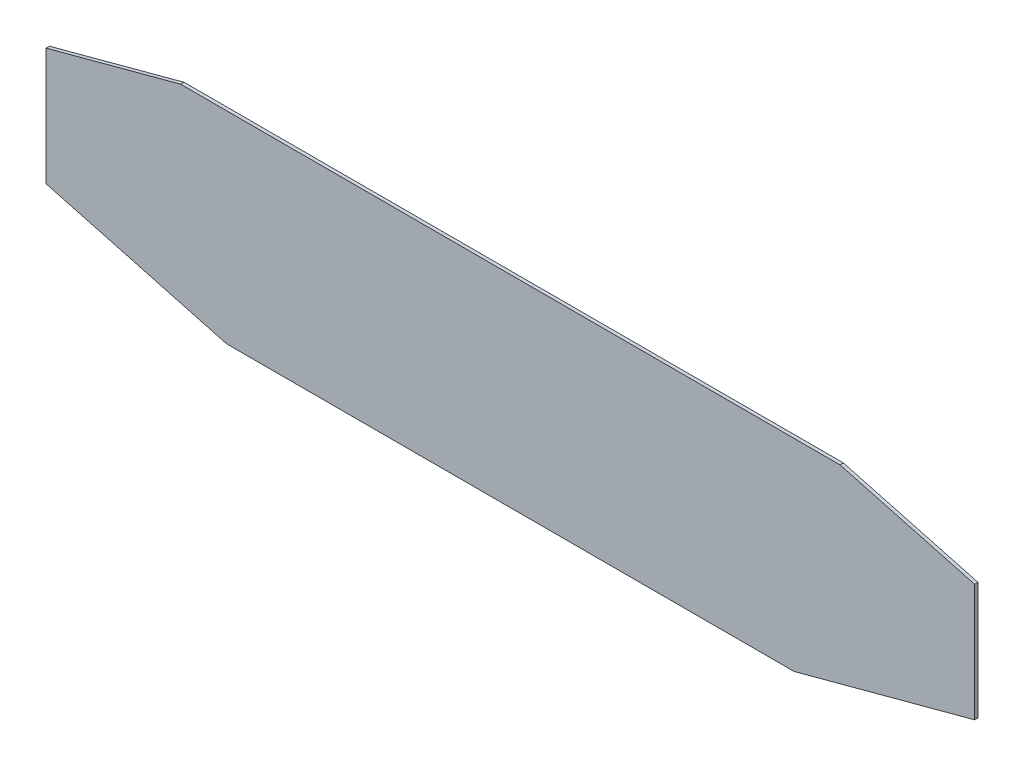
ISO-10303-21;
HEADER;
FILE_DESCRIPTION(('STEP AP214'),'2;1');
FILE_NAME('part.step','',(''),(''),'','','');
FILE_SCHEMA(('AUTOMOTIVE_DESIGN { 1 0 10303 214 1 1 1 1 }'));
ENDSEC;
DATA;
#1=APPLICATION_CONTEXT('core data for automotive mechanical design processes');
#2=APPLICATION_PROTOCOL_DEFINITION('international standard','automotive_design',2000,#1);
#3=PRODUCT_CONTEXT('',#1,'mechanical');
#4=PRODUCT('Part','Part','',(#3));
#5=PRODUCT_RELATED_PRODUCT_CATEGORY('part','',(#4));
#6=PRODUCT_DEFINITION_FORMATION('','',#4);
#7=PRODUCT_DEFINITION_CONTEXT('part definition',#1,'design');
#8=PRODUCT_DEFINITION('design','',#6,#7);
#9=PRODUCT_DEFINITION_SHAPE('','',#8);
#10=(LENGTH_UNIT() NAMED_UNIT(*) SI_UNIT(.MILLI.,.METRE.));
#11=(NAMED_UNIT(*) PLANE_ANGLE_UNIT() SI_UNIT($,.RADIAN.));
#12=(NAMED_UNIT(*) SI_UNIT($,.STERADIAN.) SOLID_ANGLE_UNIT());
#13=UNCERTAINTY_MEASURE_WITH_UNIT(LENGTH_MEASURE(1.E-05),#10,'distance_accuracy_value','');
#14=(GEOMETRIC_REPRESENTATION_CONTEXT(3) GLOBAL_UNCERTAINTY_ASSIGNED_CONTEXT((#13)) GLOBAL_UNIT_ASSIGNED_CONTEXT((#10,
#11,#12)) REPRESENTATION_CONTEXT('',''));
#15=CARTESIAN_POINT('',(0.,0.,0.));
#16=DIRECTION('',(0.,0.,1.));
#17=DIRECTION('',(1.,0.,0.));
#18=AXIS2_PLACEMENT_3D('',#15,#16,#17);
#19=CARTESIAN_POINT('',(-32.3471328218429,120.721143170299,1.5));
#20=DIRECTION('',(-0.258819045102515,0.96592582628907,0.));
#21=DIRECTION('',(-0.96592582628907,-0.258819045102515,0.));
#22=AXIS2_PLACEMENT_3D('',#19,#20,#21);
#23=PLANE('',#22);
#24=DIRECTION('',(0.96592582628907,0.258819045102515,0.));
#25=VECTOR('',#24,1.);
#26=CARTESIAN_POINT('',(-32.3471328218429,120.721143170299,0.));
#27=LINE('',#26,#25);
#28=CARTESIAN_POINT('',(-207.,73.923048454133,0.));
#29=VERTEX_POINT('',#28);
#30=CARTESIAN_POINT('',(-147.,90.,0.));
#31=VERTEX_POINT('',#30);
#32=EDGE_CURVE('E126',#29,#31,#27,.T.);
#33=ORIENTED_EDGE('',*,*,#32,.F.);
#34=DIRECTION('',(0.,0.,-1.));
#35=VECTOR('',#34,1.);
#36=CARTESIAN_POINT('',(-207.,73.923048454133,1.5));
#37=LINE('',#36,#35);
#38=CARTESIAN_POINT('',(-207.,73.923048454133,1.5));
#39=VERTEX_POINT('',#38);
#40=EDGE_CURVE('E11',#39,#29,#37,.T.);
#41=ORIENTED_EDGE('',*,*,#40,.F.);
#42=DIRECTION('',(0.96592582628907,0.258819045102515,0.));
#43=VECTOR('',#42,1.);
#44=CARTESIAN_POINT('',(-32.3471328218429,120.721143170299,1.5));
#45=LINE('',#44,#43);
#46=CARTESIAN_POINT('',(-147.,90.,1.5));
#47=VERTEX_POINT('',#46);
#48=EDGE_CURVE('E144',#39,#47,#45,.T.);
#49=ORIENTED_EDGE('',*,*,#48,.T.);
#50=DIRECTION('',(0.,0.,-1.));
#51=VECTOR('',#50,1.);
#52=CARTESIAN_POINT('',(-147.,90.,1.5));
#53=LINE('',#52,#51);
#54=EDGE_CURVE('E49',#47,#31,#53,.T.);
#55=ORIENTED_EDGE('',*,*,#54,.T.);
#56=EDGE_LOOP('',(#33,#41,#49,#55));
#57=FACE_BOUND('',#56,.T.);
#58=ADVANCED_FACE('F33',(#57),#23,.T.);
#59=CARTESIAN_POINT('',(-207.,2.1948652253002E-13,1.5));
#60=DIRECTION('',(-1.,0.,0.));
#61=DIRECTION('',(0.,-1.,0.));
#62=AXIS2_PLACEMENT_3D('',#59,#60,#61);
#63=PLANE('',#62);
#64=DIRECTION('',(0.,1.,0.));
#65=VECTOR('',#64,1.);
#66=CARTESIAN_POINT('',(-207.,2.1948652253002E-13,0.));
#67=LINE('',#66,#65);
#68=CARTESIAN_POINT('',(-207.,21.5699099907055,0.));
#69=VERTEX_POINT('',#68);
#70=EDGE_CURVE('E128',#69,#29,#67,.T.);
#71=ORIENTED_EDGE('',*,*,#70,.F.);
#72=DIRECTION('',(0.,0.,-1.));
#73=VECTOR('',#72,1.);
#74=CARTESIAN_POINT('',(-207.,21.5699099907055,1.5));
#75=LINE('',#74,#73);
#76=CARTESIAN_POINT('',(-207.,21.5699099907055,1.5));
#77=VERTEX_POINT('',#76);
#78=EDGE_CURVE('E41',#77,#69,#75,.T.);
#79=ORIENTED_EDGE('',*,*,#78,.F.);
#80=DIRECTION('',(0.,1.,0.));
#81=VECTOR('',#80,1.);
#82=CARTESIAN_POINT('',(-207.,2.1948652253002E-13,1.5));
#83=LINE('',#82,#81);
#84=EDGE_CURVE('E177',#77,#39,#83,.T.);
#85=ORIENTED_EDGE('',*,*,#84,.T.);
#86=ORIENTED_EDGE('',*,*,#40,.T.);
#87=EDGE_LOOP('',(#71,#79,#85,#86));
#88=FACE_BOUND('',#87,.T.);
#89=ADVANCED_FACE('F162',(#88),#63,.T.);
#90=CARTESIAN_POINT('',(-8.47389321063431,-31.6250000000001,1.5));
#91=DIRECTION('',(-0.258819045102522,-0.965925826289068,0.));
#92=DIRECTION('',(0.965925826289068,-0.258819045102522,0.));
#93=AXIS2_PLACEMENT_3D('',#90,#91,#92);
#94=PLANE('',#93);
#95=DIRECTION('',(-0.965925826289068,0.258819045102522,0.));
#96=VECTOR('',#95,1.);
#97=CARTESIAN_POINT('',(-8.47389321063431,-31.6250000000001,0.));
#98=LINE('',#97,#96);
#99=CARTESIAN_POINT('',(-126.5,0.,0.));
#100=VERTEX_POINT('',#99);
#101=EDGE_CURVE('E131',#100,#69,#98,.T.);
#102=ORIENTED_EDGE('',*,*,#101,.F.);
#103=DIRECTION('',(0.,0.,-1.));
#104=VECTOR('',#103,1.);
#105=CARTESIAN_POINT('',(-126.5,0.,1.5));
#106=LINE('',#105,#104);
#107=CARTESIAN_POINT('',(-126.5,0.,1.5));
#108=VERTEX_POINT('',#107);
#109=EDGE_CURVE('E151',#108,#100,#106,.T.);
#110=ORIENTED_EDGE('',*,*,#109,.F.);
#111=DIRECTION('',(-0.965925826289068,0.258819045102522,0.));
#112=VECTOR('',#111,1.);
#113=CARTESIAN_POINT('',(-8.47389321063431,-31.6250000000001,1.5));
#114=LINE('',#113,#112);
#115=EDGE_CURVE('E158',#108,#77,#114,.T.);
#116=ORIENTED_EDGE('',*,*,#115,.T.);
#117=ORIENTED_EDGE('',*,*,#78,.T.);
#118=EDGE_LOOP('',(#102,#110,#116,#117));
#119=FACE_BOUND('',#118,.T.);
#120=ADVANCED_FACE('F156',(#119),#94,.T.);
#121=CARTESIAN_POINT('',(0.,0.,1.5));
#122=DIRECTION('',(0.,1.,0.));
#123=DIRECTION('',(0.,0.,1.));
#124=AXIS2_PLACEMENT_3D('',#121,#122,#123);
#125=PLANE('',#124);
#126=DIRECTION('',(1.,0.,0.));
#127=VECTOR('',#126,1.);
#128=CARTESIAN_POINT('',(0.,0.,0.));
#129=LINE('',#128,#127);
#130=CARTESIAN_POINT('',(126.5,0.,0.));
#131=VERTEX_POINT('',#130);
#132=EDGE_CURVE('E134',#100,#131,#129,.T.);
#133=ORIENTED_EDGE('',*,*,#132,.T.);
#134=DIRECTION('',(0.,0.,-1.));
#135=VECTOR('',#134,1.);
#136=CARTESIAN_POINT('',(126.5,0.,1.5));
#137=LINE('',#136,#135);
#138=CARTESIAN_POINT('',(126.5,0.,1.5));
#139=VERTEX_POINT('',#138);
#140=EDGE_CURVE('E148',#139,#131,#137,.T.);
#141=ORIENTED_EDGE('',*,*,#140,.F.);
#142=DIRECTION('',(1.,0.,0.));
#143=VECTOR('',#142,1.);
#144=CARTESIAN_POINT('',(0.,0.,1.5));
#145=LINE('',#144,#143);
#146=EDGE_CURVE('E173',#108,#139,#145,.T.);
#147=ORIENTED_EDGE('',*,*,#146,.F.);
#148=ORIENTED_EDGE('',*,*,#109,.T.);
#149=EDGE_LOOP('',(#133,#141,#147,#148));
#150=FACE_BOUND('',#149,.T.);
#151=ADVANCED_FACE('F169',(#150),#125,.F.);
#152=CARTESIAN_POINT('',(8.47389321063431,-31.6250000000001,1.5));
#153=DIRECTION('',(-0.258819045102522,0.965925826289068,0.));
#154=DIRECTION('',(-0.965925826289068,-0.258819045102522,0.));
#155=AXIS2_PLACEMENT_3D('',#152,#153,#154);
#156=PLANE('',#155);
#157=DIRECTION('',(0.965925826289068,0.258819045102522,0.));
#158=VECTOR('',#157,1.);
#159=CARTESIAN_POINT('',(8.47389321063431,-31.6250000000001,0.));
#160=LINE('',#159,#158);
#161=CARTESIAN_POINT('',(207.,21.5699099907055,0.));
#162=VERTEX_POINT('',#161);
#163=EDGE_CURVE('E136',#131,#162,#160,.T.);
#164=ORIENTED_EDGE('',*,*,#163,.T.);
#165=DIRECTION('',(0.,0.,-1.));
#166=VECTOR('',#165,1.);
#167=CARTESIAN_POINT('',(207.,21.5699099907055,1.5));
#168=LINE('',#167,#166);
#169=CARTESIAN_POINT('',(207.,21.5699099907055,1.5));
#170=VERTEX_POINT('',#169);
#171=EDGE_CURVE('E118',#170,#162,#168,.T.);
#172=ORIENTED_EDGE('',*,*,#171,.F.);
#173=DIRECTION('',(0.965925826289068,0.258819045102522,0.));
#174=VECTOR('',#173,1.);
#175=CARTESIAN_POINT('',(8.47389321063431,-31.6250000000001,1.5));
#176=LINE('',#175,#174);
#177=EDGE_CURVE('E106',#139,#170,#176,.T.);
#178=ORIENTED_EDGE('',*,*,#177,.F.);
#179=ORIENTED_EDGE('',*,*,#140,.T.);
#180=EDGE_LOOP('',(#164,#172,#178,#179));
#181=FACE_BOUND('',#180,.T.);
#182=ADVANCED_FACE('F172',(#181),#156,.F.);
#183=CARTESIAN_POINT('',(207.,2.1948652253002E-13,1.5));
#184=DIRECTION('',(-1.,0.,0.));
#185=DIRECTION('',(0.,-1.,0.));
#186=AXIS2_PLACEMENT_3D('',#183,#184,#185);
#187=PLANE('',#186);
#188=DIRECTION('',(0.,1.,0.));
#189=VECTOR('',#188,1.);
#190=CARTESIAN_POINT('',(207.,2.1948652253002E-13,0.));
#191=LINE('',#190,#189);
#192=CARTESIAN_POINT('',(207.,73.923048454133,0.));
#193=VERTEX_POINT('',#192);
#194=EDGE_CURVE('E115',#162,#193,#191,.T.);
#195=ORIENTED_EDGE('',*,*,#194,.T.);
#196=DIRECTION('',(0.,0.,-1.));
#197=VECTOR('',#196,1.);
#198=CARTESIAN_POINT('',(207.,73.923048454133,1.5));
#199=LINE('',#198,#197);
#200=CARTESIAN_POINT('',(207.,73.923048454133,1.5));
#201=VERTEX_POINT('',#200);
#202=EDGE_CURVE('E112',#201,#193,#199,.T.);
#203=ORIENTED_EDGE('',*,*,#202,.F.);
#204=DIRECTION('',(0.,1.,0.));
#205=VECTOR('',#204,1.);
#206=CARTESIAN_POINT('',(207.,2.1948652253002E-13,1.5));
#207=LINE('',#206,#205);
#208=EDGE_CURVE('E99',#170,#201,#207,.T.);
#209=ORIENTED_EDGE('',*,*,#208,.F.);
#210=ORIENTED_EDGE('',*,*,#171,.T.);
#211=EDGE_LOOP('',(#195,#203,#209,#210));
#212=FACE_BOUND('',#211,.T.);
#213=ADVANCED_FACE('F113',(#212),#187,.F.);
#214=CARTESIAN_POINT('',(32.3471328218428,120.721143170299,1.5));
#215=DIRECTION('',(-0.258819045102515,-0.96592582628907,0.));
#216=DIRECTION('',(0.96592582628907,-0.258819045102515,0.));
#217=AXIS2_PLACEMENT_3D('',#214,#215,#216);
#218=PLANE('',#217);
#219=DIRECTION('',(-0.96592582628907,0.258819045102515,0.));
#220=VECTOR('',#219,1.);
#221=CARTESIAN_POINT('',(32.3471328218428,120.721143170299,0.));
#222=LINE('',#221,#220);
#223=CARTESIAN_POINT('',(147.,90.,0.));
#224=VERTEX_POINT('',#223);
#225=EDGE_CURVE('E139',#193,#224,#222,.T.);
#226=ORIENTED_EDGE('',*,*,#225,.T.);
#227=DIRECTION('',(0.,0.,-1.));
#228=VECTOR('',#227,1.);
#229=CARTESIAN_POINT('',(147.,90.,1.5));
#230=LINE('',#229,#228);
#231=CARTESIAN_POINT('',(147.,90.,1.5));
#232=VERTEX_POINT('',#231);
#233=EDGE_CURVE('E75',#232,#224,#230,.T.);
#234=ORIENTED_EDGE('',*,*,#233,.F.);
#235=DIRECTION('',(-0.96592582628907,0.258819045102515,0.));
#236=VECTOR('',#235,1.);
#237=CARTESIAN_POINT('',(32.3471328218428,120.721143170299,1.5));
#238=LINE('',#237,#236);
#239=EDGE_CURVE('E104',#201,#232,#238,.T.);
#240=ORIENTED_EDGE('',*,*,#239,.F.);
#241=ORIENTED_EDGE('',*,*,#202,.T.);
#242=EDGE_LOOP('',(#226,#234,#240,#241));
#243=FACE_BOUND('',#242,.T.);
#244=ADVANCED_FACE('F120',(#243),#218,.F.);
#245=CARTESIAN_POINT('',(0.,90.,1.5));
#246=DIRECTION('',(0.,1.,0.));
#247=DIRECTION('',(-1.,0.,0.));
#248=AXIS2_PLACEMENT_3D('',#245,#246,#247);
#249=PLANE('',#248);
#250=DIRECTION('',(1.,0.,0.));
#251=VECTOR('',#250,1.);
#252=CARTESIAN_POINT('',(0.,90.,0.));
#253=LINE('',#252,#251);
#254=EDGE_CURVE('E141',#31,#224,#253,.T.);
#255=ORIENTED_EDGE('',*,*,#254,.F.);
#256=ORIENTED_EDGE('',*,*,#54,.F.);
#257=DIRECTION('',(1.,0.,0.));
#258=VECTOR('',#257,1.);
#259=CARTESIAN_POINT('',(0.,90.,1.5));
#260=LINE('',#259,#258);
#261=EDGE_CURVE('E121',#47,#232,#260,.T.);
#262=ORIENTED_EDGE('',*,*,#261,.T.);
#263=ORIENTED_EDGE('',*,*,#233,.T.);
#264=EDGE_LOOP('',(#255,#256,#262,#263));
#265=FACE_BOUND('',#264,.T.);
#266=ADVANCED_FACE('F179',(#265),#249,.T.);
#267=CARTESIAN_POINT('',(0.,0.,1.5));
#268=DIRECTION('',(0.,0.,1.));
#269=DIRECTION('',(1.,0.,0.));
#270=AXIS2_PLACEMENT_3D('',#267,#268,#269);
#271=PLANE('',#270);
#272=ORIENTED_EDGE('',*,*,#48,.F.);
#273=ORIENTED_EDGE('',*,*,#84,.F.);
#274=ORIENTED_EDGE('',*,*,#115,.F.);
#275=ORIENTED_EDGE('',*,*,#146,.T.);
#276=ORIENTED_EDGE('',*,*,#177,.T.);
#277=ORIENTED_EDGE('',*,*,#208,.T.);
#278=ORIENTED_EDGE('',*,*,#239,.T.);
#279=ORIENTED_EDGE('',*,*,#261,.F.);
#280=EDGE_LOOP('',(#272,#273,#274,#275,#276,#277,#278,#279));
#281=FACE_BOUND('',#280,.T.);
#282=ADVANCED_FACE('F101',(#281),#271,.T.);
#283=CARTESIAN_POINT('',(0.,0.,0.));
#284=DIRECTION('',(0.,0.,1.));
#285=DIRECTION('',(1.,0.,0.));
#286=AXIS2_PLACEMENT_3D('',#283,#284,#285);
#287=PLANE('',#286);
#288=ORIENTED_EDGE('',*,*,#32,.T.);
#289=ORIENTED_EDGE('',*,*,#254,.T.);
#290=ORIENTED_EDGE('',*,*,#225,.F.);
#291=ORIENTED_EDGE('',*,*,#194,.F.);
#292=ORIENTED_EDGE('',*,*,#163,.F.);
#293=ORIENTED_EDGE('',*,*,#132,.F.);
#294=ORIENTED_EDGE('',*,*,#101,.T.);
#295=ORIENTED_EDGE('',*,*,#70,.T.);
#296=EDGE_LOOP('',(#288,#289,#290,#291,#292,#293,#294,#295));
#297=FACE_BOUND('',#296,.T.);
#298=ADVANCED_FACE('F165',(#297),#287,.F.);
#299=CLOSED_SHELL('',(#58,#89,#120,#151,#182,#213,#244,#266,#282,#298));
#300=MANIFOLD_SOLID_BREP('B2',#299);
#301=ADVANCED_BREP_SHAPE_REPRESENTATION('',(#18,#300),#14);
#302=SHAPE_DEFINITION_REPRESENTATION(#9,#301);
ENDSEC;
END-ISO-10303-21;
